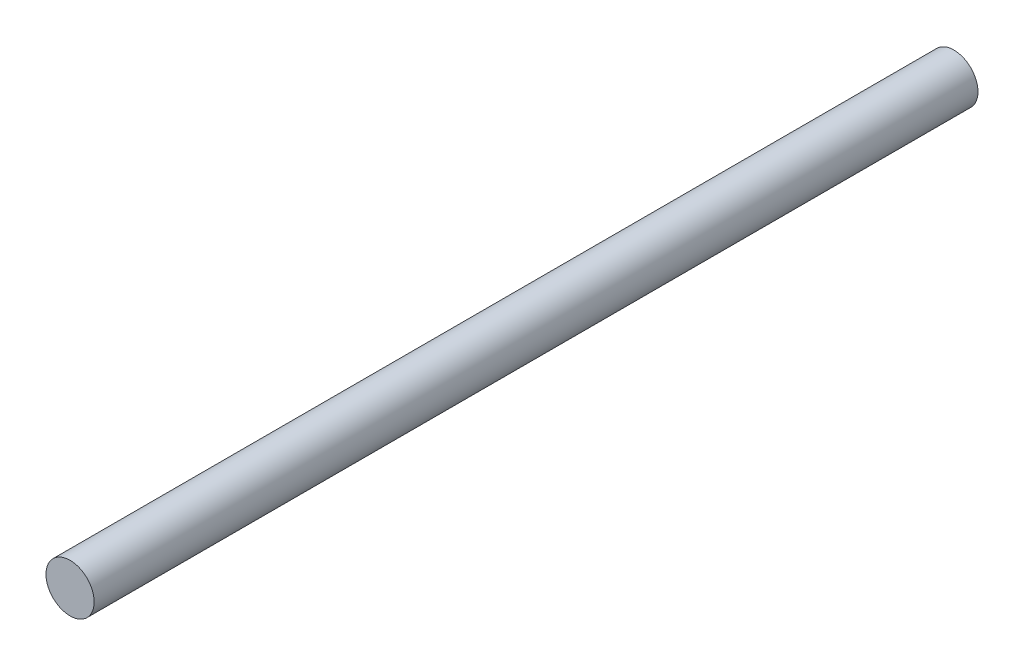
ISO-10303-21;
HEADER;
FILE_DESCRIPTION(('STEP AP214'),'2;1');
FILE_NAME('part.step','',(''),(''),'','','');
FILE_SCHEMA(('AUTOMOTIVE_DESIGN { 1 0 10303 214 1 1 1 1 }'));
ENDSEC;
DATA;
#1=APPLICATION_CONTEXT('core data for automotive mechanical design processes');
#2=APPLICATION_PROTOCOL_DEFINITION('international standard','automotive_design',2000,#1);
#3=PRODUCT_CONTEXT('',#1,'mechanical');
#4=PRODUCT('Part','Part','',(#3));
#5=PRODUCT_RELATED_PRODUCT_CATEGORY('part','',(#4));
#6=PRODUCT_DEFINITION_FORMATION('','',#4);
#7=PRODUCT_DEFINITION_CONTEXT('part definition',#1,'design');
#8=PRODUCT_DEFINITION('design','',#6,#7);
#9=PRODUCT_DEFINITION_SHAPE('','',#8);
#10=(LENGTH_UNIT() NAMED_UNIT(*) SI_UNIT(.MILLI.,.METRE.));
#11=(NAMED_UNIT(*) PLANE_ANGLE_UNIT() SI_UNIT($,.RADIAN.));
#12=(NAMED_UNIT(*) SI_UNIT($,.STERADIAN.) SOLID_ANGLE_UNIT());
#13=UNCERTAINTY_MEASURE_WITH_UNIT(LENGTH_MEASURE(1.E-05),#10,'distance_accuracy_value','');
#14=(GEOMETRIC_REPRESENTATION_CONTEXT(3) GLOBAL_UNCERTAINTY_ASSIGNED_CONTEXT((#13)) GLOBAL_UNIT_ASSIGNED_CONTEXT((#10,
#11,#12)) REPRESENTATION_CONTEXT('',''));
#15=CARTESIAN_POINT('',(0.,0.,0.));
#16=DIRECTION('',(0.,0.,1.));
#17=DIRECTION('',(1.,0.,0.));
#18=AXIS2_PLACEMENT_3D('',#15,#16,#17);
#19=CARTESIAN_POINT('',(-55.4041362530414,33.6503649635036,110.));
#20=DIRECTION('',(0.,0.,-1.));
#21=DIRECTION('',(-1.,0.,0.));
#22=AXIS2_PLACEMENT_3D('',#19,#20,#21);
#23=CYLINDRICAL_SURFACE('',#22,3.);
#24=CARTESIAN_POINT('',(-55.4041362530414,33.6503649635036,110.));
#25=DIRECTION('',(0.,0.,1.));
#26=DIRECTION('',(1.,0.,0.));
#27=AXIS2_PLACEMENT_3D('',#24,#25,#26);
#28=CIRCLE('',#27,3.);
#29=CARTESIAN_POINT('',(-52.4041362530414,33.6503649635036,110.));
#30=VERTEX_POINT('',#29);
#31=EDGE_CURVE('E10',#30,#30,#28,.T.);
#32=ORIENTED_EDGE('',*,*,#31,.F.);
#33=EDGE_LOOP('',(#32));
#34=FACE_BOUND('',#33,.T.);
#35=CARTESIAN_POINT('',(-55.4041362530414,33.6503649635036,0.));
#36=DIRECTION('',(0.,0.,1.));
#37=DIRECTION('',(1.,0.,0.));
#38=AXIS2_PLACEMENT_3D('',#35,#36,#37);
#39=CIRCLE('',#38,3.);
#40=CARTESIAN_POINT('',(-52.4041362530414,33.6503649635036,0.));
#41=VERTEX_POINT('',#40);
#42=EDGE_CURVE('E34',#41,#41,#39,.T.);
#43=ORIENTED_EDGE('',*,*,#42,.T.);
#44=EDGE_LOOP('',(#43));
#45=FACE_BOUND('',#44,.T.);
#46=ADVANCED_FACE('F31',(#34,#45),#23,.T.);
#47=CARTESIAN_POINT('',(-55.4041362530414,33.6503649635036,110.));
#48=DIRECTION('',(0.,0.,1.));
#49=DIRECTION('',(1.,0.,0.));
#50=AXIS2_PLACEMENT_3D('',#47,#48,#49);
#51=PLANE('',#50);
#52=ORIENTED_EDGE('',*,*,#31,.T.);
#53=EDGE_LOOP('',(#52));
#54=FACE_BOUND('',#53,.T.);
#55=ADVANCED_FACE('F46',(#54),#51,.T.);
#56=CARTESIAN_POINT('',(-55.4041362530414,33.6503649635036,0.));
#57=DIRECTION('',(0.,0.,1.));
#58=DIRECTION('',(1.,0.,0.));
#59=AXIS2_PLACEMENT_3D('',#56,#57,#58);
#60=PLANE('',#59);
#61=ORIENTED_EDGE('',*,*,#42,.F.);
#62=EDGE_LOOP('',(#61));
#63=FACE_BOUND('',#62,.T.);
#64=ADVANCED_FACE('F44',(#63),#60,.F.);
#65=CLOSED_SHELL('',(#46,#55,#64));
#66=MANIFOLD_SOLID_BREP('B2',#65);
#67=ADVANCED_BREP_SHAPE_REPRESENTATION('',(#18,#66),#14);
#68=SHAPE_DEFINITION_REPRESENTATION(#9,#67);
ENDSEC;
END-ISO-10303-21;
